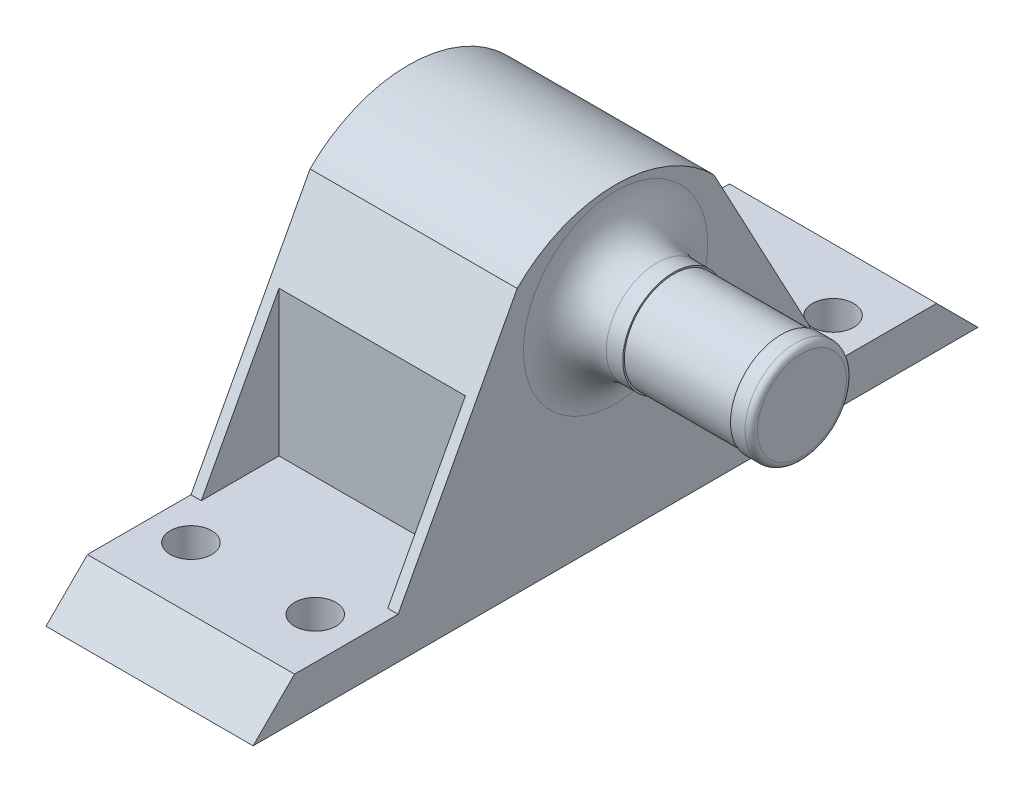
ISO-10303-21;
HEADER;
FILE_DESCRIPTION(('STEP AP214'),'2;1');
FILE_NAME('part.step','',(''),(''),'','','');
FILE_SCHEMA(('AUTOMOTIVE_DESIGN { 1 0 10303 214 1 1 1 1 }'));
ENDSEC;
DATA;
#1=APPLICATION_CONTEXT('core data for automotive mechanical design processes');
#2=APPLICATION_PROTOCOL_DEFINITION('international standard','automotive_design',2000,#1);
#3=PRODUCT_CONTEXT('',#1,'mechanical');
#4=PRODUCT('Part','Part','',(#3));
#5=PRODUCT_RELATED_PRODUCT_CATEGORY('part','',(#4));
#6=PRODUCT_DEFINITION_FORMATION('','',#4);
#7=PRODUCT_DEFINITION_CONTEXT('part definition',#1,'design');
#8=PRODUCT_DEFINITION('design','',#6,#7);
#9=PRODUCT_DEFINITION_SHAPE('','',#8);
#10=(LENGTH_UNIT() NAMED_UNIT(*) SI_UNIT(.MILLI.,.METRE.));
#11=(NAMED_UNIT(*) PLANE_ANGLE_UNIT() SI_UNIT($,.RADIAN.));
#12=(NAMED_UNIT(*) SI_UNIT($,.STERADIAN.) SOLID_ANGLE_UNIT());
#13=UNCERTAINTY_MEASURE_WITH_UNIT(LENGTH_MEASURE(1.E-05),#10,'distance_accuracy_value','');
#14=(GEOMETRIC_REPRESENTATION_CONTEXT(3) GLOBAL_UNCERTAINTY_ASSIGNED_CONTEXT((#13)) GLOBAL_UNIT_ASSIGNED_CONTEXT((#10,
#11,#12)) REPRESENTATION_CONTEXT('',''));
#15=CARTESIAN_POINT('',(0.,0.,0.));
#16=DIRECTION('',(0.,0.,1.));
#17=DIRECTION('',(1.,0.,0.));
#18=AXIS2_PLACEMENT_3D('',#15,#16,#17);
#19=CARTESIAN_POINT('',(180.,60.,-81.4));
#20=DIRECTION('',(0.,-0.707106781186551,-0.707106781186544));
#21=DIRECTION('',(0.,0.707106781186544,-0.707106781186551));
#22=AXIS2_PLACEMENT_3D('',#19,#20,#21);
#23=PLANE('',#22);
#24=DIRECTION('',(0.,-0.707106781186544,0.707106781186551));
#25=VECTOR('',#24,1.);
#26=CARTESIAN_POINT('',(180.,60.,-81.4));
#27=LINE('',#26,#25);
#28=CARTESIAN_POINT('',(180.,62.,-83.4));
#29=VERTEX_POINT('',#28);
#30=CARTESIAN_POINT('',(180.,60.,-81.4));
#31=VERTEX_POINT('',#30);
#32=EDGE_CURVE('E291',#29,#31,#27,.T.);
#33=ORIENTED_EDGE('',*,*,#32,.F.);
#34=DIRECTION('',(1.,0.,0.));
#35=VECTOR('',#34,1.);
#36=CARTESIAN_POINT('',(180.,62.,-83.4));
#37=LINE('',#36,#35);
#38=CARTESIAN_POINT('',(170.,62.,-83.4));
#39=VERTEX_POINT('',#38);
#40=EDGE_CURVE('E237',#39,#29,#37,.T.);
#41=ORIENTED_EDGE('',*,*,#40,.F.);
#42=DIRECTION('',(0.,-0.707106781186544,0.707106781186551));
#43=VECTOR('',#42,1.);
#44=CARTESIAN_POINT('',(170.,60.,-81.4));
#45=LINE('',#44,#43);
#46=CARTESIAN_POINT('',(170.,60.,-81.4));
#47=VERTEX_POINT('',#46);
#48=EDGE_CURVE('E66',#39,#47,#45,.T.);
#49=ORIENTED_EDGE('',*,*,#48,.T.);
#50=DIRECTION('',(-1.,0.,0.));
#51=VECTOR('',#50,1.);
#52=CARTESIAN_POINT('',(180.,60.,-81.4));
#53=LINE('',#52,#51);
#54=EDGE_CURVE('E294',#31,#47,#53,.T.);
#55=ORIENTED_EDGE('',*,*,#54,.F.);
#56=EDGE_LOOP('',(#33,#41,#49,#55));
#57=FACE_BOUND('',#56,.T.);
#58=ADVANCED_FACE('F40',(#57),#23,.F.);
#59=CARTESIAN_POINT('',(178.,60.,-86.4));
#60=DIRECTION('',(0.,-1.,0.));
#61=DIRECTION('',(0.,0.,-1.));
#62=AXIS2_PLACEMENT_3D('',#59,#60,#61);
#63=CYLINDRICAL_SURFACE('',#62,1.);
#64=CARTESIAN_POINT('',(178.,60.,-86.4));
#65=DIRECTION('',(0.,-1.,0.));
#66=DIRECTION('',(0.,0.,-1.));
#67=AXIS2_PLACEMENT_3D('',#64,#65,#66);
#68=CIRCLE('',#67,1.);
#69=CARTESIAN_POINT('',(178.,60.,-87.4));
#70=VERTEX_POINT('',#69);
#71=EDGE_CURVE('E250',#70,#70,#68,.T.);
#72=ORIENTED_EDGE('',*,*,#71,.T.);
#73=EDGE_LOOP('',(#72));
#74=FACE_BOUND('',#73,.T.);
#75=CARTESIAN_POINT('',(178.,62.,-86.4));
#76=DIRECTION('',(0.,1.,0.));
#77=DIRECTION('',(0.,0.,1.));
#78=AXIS2_PLACEMENT_3D('',#75,#76,#77);
#79=CIRCLE('',#78,1.);
#80=CARTESIAN_POINT('',(178.,62.,-85.4));
#81=VERTEX_POINT('',#80);
#82=EDGE_CURVE('E233',#81,#81,#79,.F.);
#83=ORIENTED_EDGE('',*,*,#82,.F.);
#84=EDGE_LOOP('',(#83));
#85=FACE_BOUND('',#84,.T.);
#86=ADVANCED_FACE('F335',(#74,#85),#63,.F.);
#87=CARTESIAN_POINT('',(172.,60.,-86.4));
#88=DIRECTION('',(0.,-1.,0.));
#89=DIRECTION('',(0.,0.,-1.));
#90=AXIS2_PLACEMENT_3D('',#87,#88,#89);
#91=CYLINDRICAL_SURFACE('',#90,1.);
#92=CARTESIAN_POINT('',(172.,60.,-86.4));
#93=DIRECTION('',(0.,-1.,0.));
#94=DIRECTION('',(0.,0.,-1.));
#95=AXIS2_PLACEMENT_3D('',#92,#93,#94);
#96=CIRCLE('',#95,1.);
#97=CARTESIAN_POINT('',(172.,60.,-87.4));
#98=VERTEX_POINT('',#97);
#99=EDGE_CURVE('E246',#98,#98,#96,.T.);
#100=ORIENTED_EDGE('',*,*,#99,.T.);
#101=EDGE_LOOP('',(#100));
#102=FACE_BOUND('',#101,.T.);
#103=CARTESIAN_POINT('',(172.,62.,-86.4));
#104=DIRECTION('',(0.,1.,0.));
#105=DIRECTION('',(0.,0.,1.));
#106=AXIS2_PLACEMENT_3D('',#103,#104,#105);
#107=CIRCLE('',#106,1.);
#108=CARTESIAN_POINT('',(172.,62.,-85.4));
#109=VERTEX_POINT('',#108);
#110=EDGE_CURVE('E214',#109,#109,#107,.F.);
#111=ORIENTED_EDGE('',*,*,#110,.F.);
#112=EDGE_LOOP('',(#111));
#113=FACE_BOUND('',#112,.T.);
#114=ADVANCED_FACE('F332',(#102,#113),#91,.F.);
#115=CARTESIAN_POINT('',(189.,70.,-98.9));
#116=DIRECTION('',(-1.,0.,0.));
#117=DIRECTION('',(0.,0.,1.));
#118=AXIS2_PLACEMENT_3D('',#115,#116,#117);
#119=CYLINDRICAL_SURFACE('',#118,2.45);
#120=CARTESIAN_POINT('',(182.,70.,-98.9));
#121=DIRECTION('',(-1.,0.,0.));
#122=DIRECTION('',(0.,0.,1.));
#123=AXIS2_PLACEMENT_3D('',#120,#121,#122);
#124=CIRCLE('',#123,2.45);
#125=CARTESIAN_POINT('',(182.,70.,-96.45));
#126=VERTEX_POINT('',#125);
#127=EDGE_CURVE('E50',#126,#126,#124,.F.);
#128=ORIENTED_EDGE('',*,*,#127,.T.);
#129=EDGE_LOOP('',(#128));
#130=FACE_BOUND('',#129,.T.);
#131=CARTESIAN_POINT('',(182.8,70.,-98.9));
#132=DIRECTION('',(1.,0.,0.));
#133=DIRECTION('',(0.,0.,-1.));
#134=AXIS2_PLACEMENT_3D('',#131,#132,#133);
#135=CIRCLE('',#134,2.45);
#136=CARTESIAN_POINT('',(182.8,70.,-101.35));
#137=VERTEX_POINT('',#136);
#138=EDGE_CURVE('E271',#137,#137,#135,.T.);
#139=ORIENTED_EDGE('',*,*,#138,.F.);
#140=EDGE_LOOP('',(#139));
#141=FACE_BOUND('',#140,.T.);
#142=ADVANCED_FACE('F334',(#130,#141),#119,.T.);
#143=CARTESIAN_POINT('',(180.,60.,-116.4));
#144=DIRECTION('',(0.,-0.707106781186551,0.707106781186544));
#145=DIRECTION('',(0.,-0.707106781186544,-0.707106781186551));
#146=AXIS2_PLACEMENT_3D('',#143,#144,#145);
#147=PLANE('',#146);
#148=DIRECTION('',(0.,0.707106781186544,0.707106781186551));
#149=VECTOR('',#148,1.);
#150=CARTESIAN_POINT('',(170.,60.,-116.4));
#151=LINE('',#150,#149);
#152=CARTESIAN_POINT('',(170.,60.,-116.4));
#153=VERTEX_POINT('',#152);
#154=CARTESIAN_POINT('',(170.,62.,-114.4));
#155=VERTEX_POINT('',#154);
#156=EDGE_CURVE('E297',#153,#155,#151,.T.);
#157=ORIENTED_EDGE('',*,*,#156,.T.);
#158=DIRECTION('',(1.,0.,0.));
#159=VECTOR('',#158,1.);
#160=CARTESIAN_POINT('',(180.,62.,-114.4));
#161=LINE('',#160,#159);
#162=CARTESIAN_POINT('',(180.,62.,-114.4));
#163=VERTEX_POINT('',#162);
#164=EDGE_CURVE('E171',#155,#163,#161,.T.);
#165=ORIENTED_EDGE('',*,*,#164,.T.);
#166=DIRECTION('',(0.,0.707106781186544,0.707106781186551));
#167=VECTOR('',#166,1.);
#168=CARTESIAN_POINT('',(180.,60.,-116.4));
#169=LINE('',#168,#167);
#170=CARTESIAN_POINT('',(180.,60.,-116.4));
#171=VERTEX_POINT('',#170);
#172=EDGE_CURVE('E283',#171,#163,#169,.T.);
#173=ORIENTED_EDGE('',*,*,#172,.F.);
#174=DIRECTION('',(-1.,0.,0.));
#175=VECTOR('',#174,1.);
#176=CARTESIAN_POINT('',(180.,60.,-116.4));
#177=LINE('',#176,#175);
#178=EDGE_CURVE('E312',#171,#153,#177,.T.);
#179=ORIENTED_EDGE('',*,*,#178,.T.);
#180=EDGE_LOOP('',(#157,#165,#173,#179));
#181=FACE_BOUND('',#180,.T.);
#182=ADVANCED_FACE('F342',(#181),#147,.F.);
#183=CARTESIAN_POINT('',(180.,68.,-98.9));
#184=DIRECTION('',(-1.,0.,0.));
#185=DIRECTION('',(0.,0.,1.));
#186=AXIS2_PLACEMENT_3D('',#183,#184,#185);
#187=CYLINDRICAL_SURFACE('',#186,6.71751442127211);
#188=CARTESIAN_POINT('',(170.,68.,-98.9));
#189=DIRECTION('',(1.,0.,0.));
#190=DIRECTION('',(0.,0.,1.));
#191=AXIS2_PLACEMENT_3D('',#188,#189,#190);
#192=CIRCLE('',#191,6.71751442127211);
#193=CARTESIAN_POINT('',(170.,72.75,-103.65));
#194=VERTEX_POINT('',#193);
#195=CARTESIAN_POINT('',(170.,72.75,-94.1500000000001));
#196=VERTEX_POINT('',#195);
#197=EDGE_CURVE('E163',#194,#196,#192,.T.);
#198=ORIENTED_EDGE('',*,*,#197,.T.);
#199=DIRECTION('',(-1.,0.,0.));
#200=VECTOR('',#199,1.);
#201=CARTESIAN_POINT('',(180.,72.75,-94.1500000000001));
#202=LINE('',#201,#200);
#203=CARTESIAN_POINT('',(180.,72.75,-94.1500000000001));
#204=VERTEX_POINT('',#203);
#205=EDGE_CURVE('E306',#204,#196,#202,.T.);
#206=ORIENTED_EDGE('',*,*,#205,.F.);
#207=CARTESIAN_POINT('',(180.,68.,-98.9));
#208=DIRECTION('',(1.,0.,0.));
#209=DIRECTION('',(0.,0.,1.));
#210=AXIS2_PLACEMENT_3D('',#207,#208,#209);
#211=CIRCLE('',#210,6.71751442127211);
#212=CARTESIAN_POINT('',(180.,72.75,-103.65));
#213=VERTEX_POINT('',#212);
#214=EDGE_CURVE('E287',#213,#204,#211,.T.);
#215=ORIENTED_EDGE('',*,*,#214,.F.);
#216=DIRECTION('',(-1.,0.,0.));
#217=VECTOR('',#216,1.);
#218=CARTESIAN_POINT('',(180.,72.75,-103.65));
#219=LINE('',#218,#217);
#220=EDGE_CURVE('E309',#213,#194,#219,.T.);
#221=ORIENTED_EDGE('',*,*,#220,.T.);
#222=EDGE_LOOP('',(#198,#206,#215,#221));
#223=FACE_BOUND('',#222,.T.);
#224=ADVANCED_FACE('F357',(#223),#187,.T.);
#225=CARTESIAN_POINT('',(180.,68.,-98.9));
#226=DIRECTION('',(-1.,0.,0.));
#227=DIRECTION('',(0.,0.,1.));
#228=AXIS2_PLACEMENT_3D('',#225,#226,#227);
#229=PLANE('',#228);
#230=CARTESIAN_POINT('',(180.,70.,-98.9));
#231=DIRECTION('',(-1.,0.,0.));
#232=DIRECTION('',(0.,0.,1.));
#233=AXIS2_PLACEMENT_3D('',#230,#231,#232);
#234=CIRCLE('',#233,4.45);
#235=CARTESIAN_POINT('',(180.,70.,-94.45));
#236=VERTEX_POINT('',#235);
#237=EDGE_CURVE('E11',#236,#236,#234,.T.);
#238=ORIENTED_EDGE('',*,*,#237,.T.);
#239=EDGE_LOOP('',(#238));
#240=FACE_BOUND('',#239,.T.);
#241=DIRECTION('',(0.,0.,1.));
#242=VECTOR('',#241,1.);
#243=CARTESIAN_POINT('',(180.,62.,-98.9));
#244=LINE('',#243,#242);
#245=CARTESIAN_POINT('',(180.,62.,-109.4));
#246=VERTEX_POINT('',#245);
#247=EDGE_CURVE('E189',#163,#246,#244,.T.);
#248=ORIENTED_EDGE('',*,*,#247,.T.);
#249=DIRECTION('',(0.,0.881784641934689,0.471652250337166));
#250=VECTOR('',#249,1.);
#251=CARTESIAN_POINT('',(180.,71.0321698906644,-104.568839360807));
#252=LINE('',#251,#250);
#253=EDGE_CURVE('E180',#246,#213,#252,.T.);
#254=ORIENTED_EDGE('',*,*,#253,.T.);
#255=ORIENTED_EDGE('',*,*,#214,.T.);
#256=DIRECTION('',(0.,-0.881784641934689,0.471652250337166));
#257=VECTOR('',#256,1.);
#258=CARTESIAN_POINT('',(180.,71.0321698906644,-93.2311606391927));
#259=LINE('',#258,#257);
#260=CARTESIAN_POINT('',(180.,62.,-88.4));
#261=VERTEX_POINT('',#260);
#262=EDGE_CURVE('E411',#204,#261,#259,.T.);
#263=ORIENTED_EDGE('',*,*,#262,.T.);
#264=DIRECTION('',(0.,0.,1.));
#265=VECTOR('',#264,1.);
#266=CARTESIAN_POINT('',(180.,62.,-98.9));
#267=LINE('',#266,#265);
#268=EDGE_CURVE('E193',#261,#29,#267,.T.);
#269=ORIENTED_EDGE('',*,*,#268,.T.);
#270=ORIENTED_EDGE('',*,*,#32,.T.);
#271=DIRECTION('',(0.,0.,-1.));
#272=VECTOR('',#271,1.);
#273=CARTESIAN_POINT('',(180.,60.,-81.4));
#274=LINE('',#273,#272);
#275=EDGE_CURVE('E279',#31,#171,#274,.T.);
#276=ORIENTED_EDGE('',*,*,#275,.T.);
#277=ORIENTED_EDGE('',*,*,#172,.T.);
#278=EDGE_LOOP('',(#248,#254,#255,#263,#269,#270,#276,#277));
#279=FACE_BOUND('',#278,.T.);
#280=ADVANCED_FACE('F360',(#240,#279),#229,.F.);
#281=CARTESIAN_POINT('',(170.,68.,-98.9));
#282=DIRECTION('',(-1.,0.,0.));
#283=DIRECTION('',(0.,0.,1.));
#284=AXIS2_PLACEMENT_3D('',#281,#282,#283);
#285=PLANE('',#284);
#286=DIRECTION('',(0.,0.881784641934689,0.471652250337166));
#287=VECTOR('',#286,1.);
#288=CARTESIAN_POINT('',(170.,72.75,-103.65));
#289=LINE('',#288,#287);
#290=CARTESIAN_POINT('',(170.,62.,-109.4));
#291=VERTEX_POINT('',#290);
#292=EDGE_CURVE('E145',#291,#194,#289,.T.);
#293=ORIENTED_EDGE('',*,*,#292,.F.);
#294=DIRECTION('',(0.,0.,1.));
#295=VECTOR('',#294,1.);
#296=CARTESIAN_POINT('',(170.,62.,-114.4));
#297=LINE('',#296,#295);
#298=EDGE_CURVE('E153',#155,#291,#297,.T.);
#299=ORIENTED_EDGE('',*,*,#298,.F.);
#300=ORIENTED_EDGE('',*,*,#156,.F.);
#301=DIRECTION('',(0.,0.,-1.));
#302=VECTOR('',#301,1.);
#303=CARTESIAN_POINT('',(170.,60.,-81.4));
#304=LINE('',#303,#302);
#305=EDGE_CURVE('E275',#47,#153,#304,.T.);
#306=ORIENTED_EDGE('',*,*,#305,.F.);
#307=ORIENTED_EDGE('',*,*,#48,.F.);
#308=DIRECTION('',(0.,0.,1.));
#309=VECTOR('',#308,1.);
#310=CARTESIAN_POINT('',(170.,62.,-83.4));
#311=LINE('',#310,#309);
#312=CARTESIAN_POINT('',(170.,62.,-88.4));
#313=VERTEX_POINT('',#312);
#314=EDGE_CURVE('E183',#313,#39,#311,.T.);
#315=ORIENTED_EDGE('',*,*,#314,.F.);
#316=DIRECTION('',(0.,-0.881784641934689,0.471652250337166));
#317=VECTOR('',#316,1.);
#318=CARTESIAN_POINT('',(170.,62.,-88.4));
#319=LINE('',#318,#317);
#320=EDGE_CURVE('E166',#196,#313,#319,.T.);
#321=ORIENTED_EDGE('',*,*,#320,.F.);
#322=ORIENTED_EDGE('',*,*,#197,.F.);
#323=EDGE_LOOP('',(#293,#299,#300,#306,#307,#315,#321,#322));
#324=FACE_BOUND('',#323,.T.);
#325=ADVANCED_FACE('F158',(#324),#285,.T.);
#326=CARTESIAN_POINT('',(182.8,70.,-98.9));
#327=DIRECTION('',(1.,0.,0.));
#328=DIRECTION('',(0.,0.,-1.));
#329=AXIS2_PLACEMENT_3D('',#326,#327,#328);
#330=PLANE('',#329);
#331=CARTESIAN_POINT('',(182.8,70.,-98.9));
#332=DIRECTION('',(1.,0.,0.));
#333=DIRECTION('',(0.,0.,-1.));
#334=AXIS2_PLACEMENT_3D('',#331,#332,#333);
#335=CIRCLE('',#334,2.375);
#336=CARTESIAN_POINT('',(182.8,70.,-101.275));
#337=VERTEX_POINT('',#336);
#338=EDGE_CURVE('E263',#337,#337,#335,.T.);
#339=ORIENTED_EDGE('',*,*,#338,.F.);
#340=EDGE_LOOP('',(#339));
#341=FACE_BOUND('',#340,.T.);
#342=ORIENTED_EDGE('',*,*,#138,.T.);
#343=EDGE_LOOP('',(#342));
#344=FACE_BOUND('',#343,.T.);
#345=ADVANCED_FACE('F393',(#341,#344),#330,.T.);
#346=CARTESIAN_POINT('',(188.,70.,-98.9));
#347=DIRECTION('',(1.,0.,0.));
#348=DIRECTION('',(0.,0.,-1.));
#349=AXIS2_PLACEMENT_3D('',#346,#347,#348);
#350=PLANE('',#349);
#351=CARTESIAN_POINT('',(188.,70.,-98.9));
#352=DIRECTION('',(1.,0.,0.));
#353=DIRECTION('',(0.,0.,-1.));
#354=AXIS2_PLACEMENT_3D('',#351,#352,#353);
#355=CIRCLE('',#354,2.375);
#356=CARTESIAN_POINT('',(188.,70.,-101.275));
#357=VERTEX_POINT('',#356);
#358=EDGE_CURVE('E262',#357,#357,#355,.T.);
#359=ORIENTED_EDGE('',*,*,#358,.T.);
#360=EDGE_LOOP('',(#359));
#361=FACE_BOUND('',#360,.T.);
#362=CARTESIAN_POINT('',(188.,70.,-98.9));
#363=DIRECTION('',(1.,0.,0.));
#364=DIRECTION('',(0.,0.,-1.));
#365=AXIS2_PLACEMENT_3D('',#362,#363,#364);
#366=CIRCLE('',#365,2.45);
#367=CARTESIAN_POINT('',(188.,70.,-101.35));
#368=VERTEX_POINT('',#367);
#369=EDGE_CURVE('E267',#368,#368,#366,.T.);
#370=ORIENTED_EDGE('',*,*,#369,.F.);
#371=EDGE_LOOP('',(#370));
#372=FACE_BOUND('',#371,.T.);
#373=ADVANCED_FACE('F383',(#361,#372),#350,.F.);
#374=CARTESIAN_POINT('',(182.8,70.,-98.9));
#375=DIRECTION('',(1.,0.,0.));
#376=DIRECTION('',(0.,0.,-1.));
#377=AXIS2_PLACEMENT_3D('',#374,#375,#376);
#378=CYLINDRICAL_SURFACE('',#377,2.375);
#379=ORIENTED_EDGE('',*,*,#338,.T.);
#380=EDGE_LOOP('',(#379));
#381=FACE_BOUND('',#380,.T.);
#382=ORIENTED_EDGE('',*,*,#358,.F.);
#383=EDGE_LOOP('',(#382));
#384=FACE_BOUND('',#383,.T.);
#385=ADVANCED_FACE('F373',(#381,#384),#378,.T.);
#386=CARTESIAN_POINT('',(189.,70.,-98.9));
#387=DIRECTION('',(1.,0.,0.));
#388=DIRECTION('',(0.,0.,-1.));
#389=AXIS2_PLACEMENT_3D('',#386,#387,#388);
#390=PLANE('',#389);
#391=CARTESIAN_POINT('',(189.,70.,-98.9));
#392=DIRECTION('',(1.,0.,0.));
#393=DIRECTION('',(0.,0.,-1.));
#394=AXIS2_PLACEMENT_3D('',#391,#392,#393);
#395=CIRCLE('',#394,2.15);
#396=CARTESIAN_POINT('',(189.,70.,-101.05));
#397=VERTEX_POINT('',#396);
#398=EDGE_CURVE('E316',#397,#397,#395,.T.);
#399=ORIENTED_EDGE('',*,*,#398,.T.);
#400=EDGE_LOOP('',(#399));
#401=FACE_BOUND('',#400,.T.);
#402=ADVANCED_FACE('F366',(#401),#390,.T.);
#403=CARTESIAN_POINT('',(188.7,70.,-98.9));
#404=DIRECTION('',(1.,0.,0.));
#405=DIRECTION('',(0.,0.,-1.));
#406=AXIS2_PLACEMENT_3D('',#403,#404,#405);
#407=TOROIDAL_SURFACE('',#406,2.15,0.3);
#408=CARTESIAN_POINT('',(188.7,70.,-98.9));
#409=DIRECTION('',(1.,0.,0.));
#410=DIRECTION('',(0.,0.,-1.));
#411=AXIS2_PLACEMENT_3D('',#408,#409,#410);
#412=CIRCLE('',#411,2.45);
#413=CARTESIAN_POINT('',(188.7,70.,-101.35));
#414=VERTEX_POINT('',#413);
#415=EDGE_CURVE('E320',#414,#414,#412,.F.);
#416=ORIENTED_EDGE('',*,*,#415,.F.);
#417=EDGE_LOOP('',(#416));
#418=FACE_BOUND('',#417,.T.);
#419=ORIENTED_EDGE('',*,*,#398,.F.);
#420=EDGE_LOOP('',(#419));
#421=FACE_BOUND('',#420,.T.);
#422=ADVANCED_FACE('F364',(#418,#421),#407,.T.);
#423=ORIENTED_EDGE('',*,*,#369,.T.);
#424=EDGE_LOOP('',(#423));
#425=FACE_BOUND('',#424,.T.);
#426=ORIENTED_EDGE('',*,*,#415,.T.);
#427=EDGE_LOOP('',(#426));
#428=FACE_BOUND('',#427,.T.);
#429=ADVANCED_FACE('F345',(#425,#428),#119,.T.);
#430=CARTESIAN_POINT('',(182.,70.,-98.9));
#431=DIRECTION('',(-1.,0.,0.));
#432=DIRECTION('',(0.,0.,1.));
#433=AXIS2_PLACEMENT_3D('',#430,#431,#432);
#434=TOROIDAL_SURFACE('',#433,4.45,2.);
#435=ORIENTED_EDGE('',*,*,#237,.F.);
#436=EDGE_LOOP('',(#435));
#437=FACE_BOUND('',#436,.T.);
#438=ORIENTED_EDGE('',*,*,#127,.F.);
#439=EDGE_LOOP('',(#438));
#440=FACE_BOUND('',#439,.T.);
#441=ADVANCED_FACE('F42',(#437,#440),#434,.F.);
#442=CARTESIAN_POINT('',(170.,60.,251.));
#443=DIRECTION('',(0.,-1.,0.));
#444=DIRECTION('',(0.,0.,-1.));
#445=AXIS2_PLACEMENT_3D('',#442,#443,#444);
#446=PLANE('',#445);
#447=ORIENTED_EDGE('',*,*,#99,.F.);
#448=EDGE_LOOP('',(#447));
#449=FACE_BOUND('',#448,.T.);
#450=ORIENTED_EDGE('',*,*,#71,.F.);
#451=EDGE_LOOP('',(#450));
#452=FACE_BOUND('',#451,.T.);
#453=CARTESIAN_POINT('',(172.,60.,-111.4));
#454=DIRECTION('',(0.,-1.,0.));
#455=DIRECTION('',(0.,0.,-1.));
#456=AXIS2_PLACEMENT_3D('',#453,#454,#455);
#457=CIRCLE('',#456,1.);
#458=CARTESIAN_POINT('',(172.,60.,-112.4));
#459=VERTEX_POINT('',#458);
#460=EDGE_CURVE('E254',#459,#459,#457,.T.);
#461=ORIENTED_EDGE('',*,*,#460,.F.);
#462=EDGE_LOOP('',(#461));
#463=FACE_BOUND('',#462,.T.);
#464=CARTESIAN_POINT('',(178.,60.,-111.4));
#465=DIRECTION('',(0.,-1.,0.));
#466=DIRECTION('',(0.,0.,-1.));
#467=AXIS2_PLACEMENT_3D('',#464,#465,#466);
#468=CIRCLE('',#467,1.);
#469=CARTESIAN_POINT('',(178.,60.,-112.4));
#470=VERTEX_POINT('',#469);
#471=EDGE_CURVE('E258',#470,#470,#468,.T.);
#472=ORIENTED_EDGE('',*,*,#471,.F.);
#473=EDGE_LOOP('',(#472));
#474=FACE_BOUND('',#473,.T.);
#475=ORIENTED_EDGE('',*,*,#178,.F.);
#476=ORIENTED_EDGE('',*,*,#275,.F.);
#477=ORIENTED_EDGE('',*,*,#54,.T.);
#478=ORIENTED_EDGE('',*,*,#305,.T.);
#479=EDGE_LOOP('',(#475,#476,#477,#478));
#480=FACE_BOUND('',#479,.T.);
#481=ADVANCED_FACE('F480',(#449,#452,#463,#474,#480),#446,.T.);
#482=CARTESIAN_POINT('',(178.,60.,-111.4));
#483=DIRECTION('',(0.,-1.,0.));
#484=DIRECTION('',(0.,0.,-1.));
#485=AXIS2_PLACEMENT_3D('',#482,#483,#484);
#486=CYLINDRICAL_SURFACE('',#485,1.);
#487=CARTESIAN_POINT('',(178.,62.,-111.4));
#488=DIRECTION('',(0.,-1.,0.));
#489=DIRECTION('',(0.,0.,-1.));
#490=AXIS2_PLACEMENT_3D('',#487,#488,#489);
#491=CIRCLE('',#490,1.);
#492=CARTESIAN_POINT('',(178.,62.,-112.4));
#493=VERTEX_POINT('',#492);
#494=EDGE_CURVE('E240',#493,#493,#491,.F.);
#495=ORIENTED_EDGE('',*,*,#494,.T.);
#496=EDGE_LOOP('',(#495));
#497=FACE_BOUND('',#496,.T.);
#498=ORIENTED_EDGE('',*,*,#471,.T.);
#499=EDGE_LOOP('',(#498));
#500=FACE_BOUND('',#499,.T.);
#501=ADVANCED_FACE('F455',(#497,#500),#486,.F.);
#502=CARTESIAN_POINT('',(172.,60.,-111.4));
#503=DIRECTION('',(0.,-1.,0.));
#504=DIRECTION('',(0.,0.,-1.));
#505=AXIS2_PLACEMENT_3D('',#502,#503,#504);
#506=CYLINDRICAL_SURFACE('',#505,1.);
#507=CARTESIAN_POINT('',(172.,62.,-111.4));
#508=DIRECTION('',(0.,-1.,0.));
#509=DIRECTION('',(0.,0.,-1.));
#510=AXIS2_PLACEMENT_3D('',#507,#508,#509);
#511=CIRCLE('',#510,1.);
#512=CARTESIAN_POINT('',(172.,62.,-112.4));
#513=VERTEX_POINT('',#512);
#514=EDGE_CURVE('E44',#513,#513,#511,.F.);
#515=ORIENTED_EDGE('',*,*,#514,.T.);
#516=EDGE_LOOP('',(#515));
#517=FACE_BOUND('',#516,.T.);
#518=ORIENTED_EDGE('',*,*,#460,.T.);
#519=EDGE_LOOP('',(#518));
#520=FACE_BOUND('',#519,.T.);
#521=ADVANCED_FACE('F450',(#517,#520),#506,.F.);
#522=CARTESIAN_POINT('',(170.5,362.,-92.1500000000001));
#523=DIRECTION('',(-1.,0.,0.));
#524=DIRECTION('',(0.,0.,1.));
#525=AXIS2_PLACEMENT_3D('',#522,#523,#524);
#526=PLANE('',#525);
#527=DIRECTION('',(0.,-1.,0.));
#528=VECTOR('',#527,1.);
#529=CARTESIAN_POINT('',(170.5,362.,-92.1500000000001));
#530=LINE('',#529,#528);
#531=CARTESIAN_POINT('',(170.5,69.0108695652175,-92.1500000000001));
#532=VERTEX_POINT('',#531);
#533=CARTESIAN_POINT('',(170.5,62.,-92.1500000000001));
#534=VERTEX_POINT('',#533);
#535=EDGE_CURVE('E228',#532,#534,#530,.T.);
#536=ORIENTED_EDGE('',*,*,#535,.F.);
#537=DIRECTION('',(0.,-0.881784641934689,0.471652250337166));
#538=VECTOR('',#537,1.);
#539=CARTESIAN_POINT('',(170.5,296.822855340621,-214.002922624055));
#540=LINE('',#539,#538);
#541=CARTESIAN_POINT('',(170.5,62.,-88.4));
#542=VERTEX_POINT('',#541);
#543=EDGE_CURVE('E417',#532,#542,#540,.T.);
#544=ORIENTED_EDGE('',*,*,#543,.T.);
#545=DIRECTION('',(0.,0.,-1.));
#546=VECTOR('',#545,1.);
#547=CARTESIAN_POINT('',(170.5,62.,-92.1500000000001));
#548=LINE('',#547,#546);
#549=EDGE_CURVE('E197',#542,#534,#548,.T.);
#550=ORIENTED_EDGE('',*,*,#549,.T.);
#551=EDGE_LOOP('',(#536,#544,#550));
#552=FACE_BOUND('',#551,.T.);
#553=ADVANCED_FACE('F445',(#552),#526,.F.);
#554=CARTESIAN_POINT('',(179.5,362.,-92.1500000000001));
#555=DIRECTION('',(1.,0.,0.));
#556=DIRECTION('',(0.,0.,-1.));
#557=AXIS2_PLACEMENT_3D('',#554,#555,#556);
#558=PLANE('',#557);
#559=DIRECTION('',(0.,0.,1.));
#560=VECTOR('',#559,1.);
#561=CARTESIAN_POINT('',(179.5,62.,-92.1500000000001));
#562=LINE('',#561,#560);
#563=CARTESIAN_POINT('',(179.5,62.,-92.1500000000001));
#564=VERTEX_POINT('',#563);
#565=CARTESIAN_POINT('',(179.5,62.,-88.4));
#566=VERTEX_POINT('',#565);
#567=EDGE_CURVE('E224',#564,#566,#562,.T.);
#568=ORIENTED_EDGE('',*,*,#567,.T.);
#569=DIRECTION('',(0.,0.881784641934689,-0.471652250337166));
#570=VECTOR('',#569,1.);
#571=CARTESIAN_POINT('',(179.5,296.822855340621,-214.002922624055));
#572=LINE('',#571,#570);
#573=CARTESIAN_POINT('',(179.5,69.0108695652175,-92.1500000000001));
#574=VERTEX_POINT('',#573);
#575=EDGE_CURVE('E467',#566,#574,#572,.T.);
#576=ORIENTED_EDGE('',*,*,#575,.T.);
#577=DIRECTION('',(0.,-1.,0.));
#578=VECTOR('',#577,1.);
#579=CARTESIAN_POINT('',(179.5,362.,-92.1500000000001));
#580=LINE('',#579,#578);
#581=EDGE_CURVE('E202',#574,#564,#580,.T.);
#582=ORIENTED_EDGE('',*,*,#581,.T.);
#583=EDGE_LOOP('',(#568,#576,#582));
#584=FACE_BOUND('',#583,.T.);
#585=ADVANCED_FACE('F442',(#584),#558,.F.);
#586=CARTESIAN_POINT('',(170.5,362.,-92.1500000000001));
#587=DIRECTION('',(0.,0.,-1.));
#588=DIRECTION('',(-1.,0.,0.));
#589=AXIS2_PLACEMENT_3D('',#586,#587,#588);
#590=PLANE('',#589);
#591=ORIENTED_EDGE('',*,*,#581,.F.);
#592=DIRECTION('',(-1.,0.,0.));
#593=VECTOR('',#592,1.);
#594=CARTESIAN_POINT('',(170.5,69.0108695652175,-92.1500000000001));
#595=LINE('',#594,#593);
#596=EDGE_CURVE('E165',#574,#532,#595,.T.);
#597=ORIENTED_EDGE('',*,*,#596,.T.);
#598=ORIENTED_EDGE('',*,*,#535,.T.);
#599=DIRECTION('',(1.,0.,0.));
#600=VECTOR('',#599,1.);
#601=CARTESIAN_POINT('',(170.5,62.,-92.1500000000001));
#602=LINE('',#601,#600);
#603=EDGE_CURVE('E220',#534,#564,#602,.T.);
#604=ORIENTED_EDGE('',*,*,#603,.T.);
#605=EDGE_LOOP('',(#591,#597,#598,#604));
#606=FACE_BOUND('',#605,.T.);
#607=ADVANCED_FACE('F440',(#606),#590,.F.);
#608=CARTESIAN_POINT('',(0.,62.,0.));
#609=DIRECTION('',(0.,1.,0.));
#610=DIRECTION('',(0.,0.,1.));
#611=AXIS2_PLACEMENT_3D('',#608,#609,#610);
#612=PLANE('',#611);
#613=ORIENTED_EDGE('',*,*,#549,.F.);
#614=DIRECTION('',(-1.,0.,0.));
#615=VECTOR('',#614,1.);
#616=CARTESIAN_POINT('',(470.,62.,-88.4));
#617=LINE('',#616,#615);
#618=EDGE_CURVE('E177',#542,#313,#617,.T.);
#619=ORIENTED_EDGE('',*,*,#618,.T.);
#620=ORIENTED_EDGE('',*,*,#314,.T.);
#621=ORIENTED_EDGE('',*,*,#40,.T.);
#622=ORIENTED_EDGE('',*,*,#268,.F.);
#623=EDGE_CURVE('E173',#261,#566,#617,.T.);
#624=ORIENTED_EDGE('',*,*,#623,.T.);
#625=ORIENTED_EDGE('',*,*,#567,.F.);
#626=ORIENTED_EDGE('',*,*,#603,.F.);
#627=EDGE_LOOP('',(#613,#619,#620,#621,#622,#624,#625,#626));
#628=FACE_BOUND('',#627,.T.);
#629=ORIENTED_EDGE('',*,*,#82,.T.);
#630=EDGE_LOOP('',(#629));
#631=FACE_BOUND('',#630,.T.);
#632=ORIENTED_EDGE('',*,*,#110,.T.);
#633=EDGE_LOOP('',(#632));
#634=FACE_BOUND('',#633,.T.);
#635=ADVANCED_FACE('F330',(#628,#631,#634),#612,.T.);
#636=CARTESIAN_POINT('',(170.5,362.,-105.65));
#637=DIRECTION('',(-1.,0.,0.));
#638=DIRECTION('',(0.,0.,1.));
#639=AXIS2_PLACEMENT_3D('',#636,#637,#638);
#640=PLANE('',#639);
#641=DIRECTION('',(0.,0.,-1.));
#642=VECTOR('',#641,1.);
#643=CARTESIAN_POINT('',(170.5,62.,-105.65));
#644=LINE('',#643,#642);
#645=CARTESIAN_POINT('',(170.5,62.,-105.65));
#646=VERTEX_POINT('',#645);
#647=CARTESIAN_POINT('',(170.5,62.,-109.4));
#648=VERTEX_POINT('',#647);
#649=EDGE_CURVE('E198',#646,#648,#644,.T.);
#650=ORIENTED_EDGE('',*,*,#649,.T.);
#651=DIRECTION('',(0.,0.881784641934689,0.471652250337166));
#652=VECTOR('',#651,1.);
#653=CARTESIAN_POINT('',(170.5,296.822855340621,16.2029226240549));
#654=LINE('',#653,#652);
#655=CARTESIAN_POINT('',(170.5,69.0108695652175,-105.65));
#656=VERTEX_POINT('',#655);
#657=EDGE_CURVE('E58',#648,#656,#654,.T.);
#658=ORIENTED_EDGE('',*,*,#657,.T.);
#659=DIRECTION('',(0.,-1.,0.));
#660=VECTOR('',#659,1.);
#661=CARTESIAN_POINT('',(170.5,362.,-105.65));
#662=LINE('',#661,#660);
#663=EDGE_CURVE('E211',#656,#646,#662,.T.);
#664=ORIENTED_EDGE('',*,*,#663,.T.);
#665=EDGE_LOOP('',(#650,#658,#664));
#666=FACE_BOUND('',#665,.T.);
#667=ADVANCED_FACE('F424',(#666),#640,.F.);
#668=CARTESIAN_POINT('',(170.5,362.,-105.65));
#669=DIRECTION('',(0.,0.,1.));
#670=DIRECTION('',(1.,0.,0.));
#671=AXIS2_PLACEMENT_3D('',#668,#669,#670);
#672=PLANE('',#671);
#673=ORIENTED_EDGE('',*,*,#663,.F.);
#674=DIRECTION('',(1.,0.,0.));
#675=VECTOR('',#674,1.);
#676=CARTESIAN_POINT('',(170.5,69.0108695652175,-105.65));
#677=LINE('',#676,#675);
#678=CARTESIAN_POINT('',(179.5,69.0108695652175,-105.65));
#679=VERTEX_POINT('',#678);
#680=EDGE_CURVE('E410',#656,#679,#677,.T.);
#681=ORIENTED_EDGE('',*,*,#680,.T.);
#682=DIRECTION('',(0.,-1.,0.));
#683=VECTOR('',#682,1.);
#684=CARTESIAN_POINT('',(179.5,362.,-105.65));
#685=LINE('',#684,#683);
#686=CARTESIAN_POINT('',(179.5,62.,-105.65));
#687=VERTEX_POINT('',#686);
#688=EDGE_CURVE('E210',#679,#687,#685,.T.);
#689=ORIENTED_EDGE('',*,*,#688,.T.);
#690=DIRECTION('',(-1.,0.,0.));
#691=VECTOR('',#690,1.);
#692=CARTESIAN_POINT('',(170.5,62.,-105.65));
#693=LINE('',#692,#691);
#694=EDGE_CURVE('E206',#687,#646,#693,.T.);
#695=ORIENTED_EDGE('',*,*,#694,.T.);
#696=EDGE_LOOP('',(#673,#681,#689,#695));
#697=FACE_BOUND('',#696,.T.);
#698=ADVANCED_FACE('F426',(#697),#672,.F.);
#699=CARTESIAN_POINT('',(179.5,362.,-105.65));
#700=DIRECTION('',(1.,0.,0.));
#701=DIRECTION('',(0.,0.,-1.));
#702=AXIS2_PLACEMENT_3D('',#699,#700,#701);
#703=PLANE('',#702);
#704=ORIENTED_EDGE('',*,*,#688,.F.);
#705=DIRECTION('',(0.,-0.881784641934689,-0.471652250337166));
#706=VECTOR('',#705,1.);
#707=CARTESIAN_POINT('',(179.5,296.822855340621,16.2029226240549));
#708=LINE('',#707,#706);
#709=CARTESIAN_POINT('',(179.5,62.,-109.4));
#710=VERTEX_POINT('',#709);
#711=EDGE_CURVE('E404',#679,#710,#708,.T.);
#712=ORIENTED_EDGE('',*,*,#711,.T.);
#713=DIRECTION('',(0.,0.,1.));
#714=VECTOR('',#713,1.);
#715=CARTESIAN_POINT('',(179.5,62.,-105.65));
#716=LINE('',#715,#714);
#717=EDGE_CURVE('E201',#710,#687,#716,.T.);
#718=ORIENTED_EDGE('',*,*,#717,.T.);
#719=EDGE_LOOP('',(#704,#712,#718));
#720=FACE_BOUND('',#719,.T.);
#721=ADVANCED_FACE('F408',(#720),#703,.F.);
#722=CARTESIAN_POINT('',(0.,62.,0.));
#723=DIRECTION('',(0.,-1.,0.));
#724=DIRECTION('',(0.,0.,-1.));
#725=AXIS2_PLACEMENT_3D('',#722,#723,#724);
#726=PLANE('',#725);
#727=DIRECTION('',(-1.,0.,0.));
#728=VECTOR('',#727,1.);
#729=CARTESIAN_POINT('',(470.,62.,-109.4));
#730=LINE('',#729,#728);
#731=EDGE_CURVE('E142',#648,#291,#730,.T.);
#732=ORIENTED_EDGE('',*,*,#731,.F.);
#733=ORIENTED_EDGE('',*,*,#649,.F.);
#734=ORIENTED_EDGE('',*,*,#694,.F.);
#735=ORIENTED_EDGE('',*,*,#717,.F.);
#736=EDGE_CURVE('E152',#246,#710,#730,.T.);
#737=ORIENTED_EDGE('',*,*,#736,.F.);
#738=ORIENTED_EDGE('',*,*,#247,.F.);
#739=ORIENTED_EDGE('',*,*,#164,.F.);
#740=ORIENTED_EDGE('',*,*,#298,.T.);
#741=EDGE_LOOP('',(#732,#733,#734,#735,#737,#738,#739,#740));
#742=FACE_BOUND('',#741,.T.);
#743=ORIENTED_EDGE('',*,*,#494,.F.);
#744=EDGE_LOOP('',(#743));
#745=FACE_BOUND('',#744,.T.);
#746=ORIENTED_EDGE('',*,*,#514,.F.);
#747=EDGE_LOOP('',(#746));
#748=FACE_BOUND('',#747,.T.);
#749=ADVANCED_FACE('F168',(#742,#745,#748),#726,.F.);
#750=CARTESIAN_POINT('',(470.,62.,-88.4));
#751=DIRECTION('',(0.,-0.471652250337166,-0.881784641934689));
#752=DIRECTION('',(0.,0.881784641934689,-0.471652250337166));
#753=AXIS2_PLACEMENT_3D('',#750,#751,#752);
#754=PLANE('',#753);
#755=ORIENTED_EDGE('',*,*,#205,.T.);
#756=ORIENTED_EDGE('',*,*,#320,.T.);
#757=ORIENTED_EDGE('',*,*,#618,.F.);
#758=ORIENTED_EDGE('',*,*,#543,.F.);
#759=ORIENTED_EDGE('',*,*,#596,.F.);
#760=ORIENTED_EDGE('',*,*,#575,.F.);
#761=ORIENTED_EDGE('',*,*,#623,.F.);
#762=ORIENTED_EDGE('',*,*,#262,.F.);
#763=EDGE_LOOP('',(#755,#756,#757,#758,#759,#760,#761,#762));
#764=FACE_BOUND('',#763,.T.);
#765=ADVANCED_FACE('F474',(#764),#754,.F.);
#766=CARTESIAN_POINT('',(470.,72.75,-103.65));
#767=DIRECTION('',(0.,-0.471652250337166,0.881784641934689));
#768=DIRECTION('',(0.,-0.881784641934689,-0.471652250337166));
#769=AXIS2_PLACEMENT_3D('',#766,#767,#768);
#770=PLANE('',#769);
#771=ORIENTED_EDGE('',*,*,#736,.T.);
#772=ORIENTED_EDGE('',*,*,#711,.F.);
#773=ORIENTED_EDGE('',*,*,#680,.F.);
#774=ORIENTED_EDGE('',*,*,#657,.F.);
#775=ORIENTED_EDGE('',*,*,#731,.T.);
#776=ORIENTED_EDGE('',*,*,#292,.T.);
#777=ORIENTED_EDGE('',*,*,#220,.F.);
#778=ORIENTED_EDGE('',*,*,#253,.F.);
#779=EDGE_LOOP('',(#771,#772,#773,#774,#775,#776,#777,#778));
#780=FACE_BOUND('',#779,.T.);
#781=ADVANCED_FACE('F144',(#780),#770,.F.);
#782=CLOSED_SHELL('',(#58,#86,#114,#142,#182,#224,#280,#325,#345,#373,#385,#402,#422,#429,#441,
#481,#501,#521,#553,#585,#607,#635,#667,#698,#721,#749,#765,#781));
#783=MANIFOLD_SOLID_BREP('B2',#782);
#784=ADVANCED_BREP_SHAPE_REPRESENTATION('',(#18,#783),#14);
#785=SHAPE_DEFINITION_REPRESENTATION(#9,#784);
ENDSEC;
END-ISO-10303-21;
